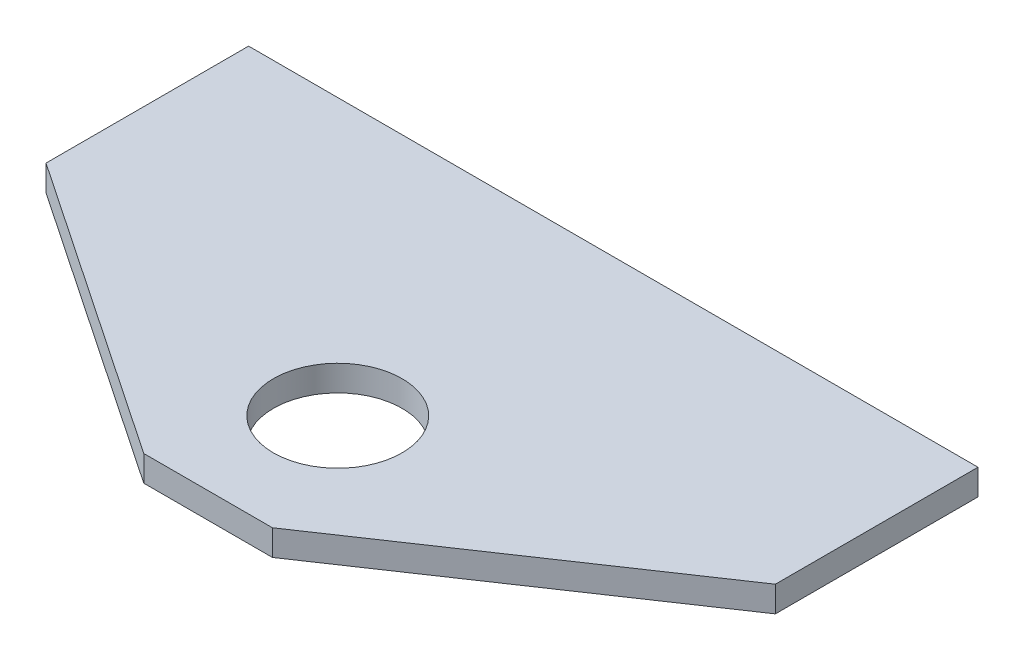
ISO-10303-21;
HEADER;
FILE_DESCRIPTION(('STEP AP214'),'2;1');
FILE_NAME('part.step','',(''),(''),'','','');
FILE_SCHEMA(('AUTOMOTIVE_DESIGN { 1 0 10303 214 1 1 1 1 }'));
ENDSEC;
DATA;
#1=APPLICATION_CONTEXT('core data for automotive mechanical design processes');
#2=APPLICATION_PROTOCOL_DEFINITION('international standard','automotive_design',2000,#1);
#3=PRODUCT_CONTEXT('',#1,'mechanical');
#4=PRODUCT('Part','Part','',(#3));
#5=PRODUCT_RELATED_PRODUCT_CATEGORY('part','',(#4));
#6=PRODUCT_DEFINITION_FORMATION('','',#4);
#7=PRODUCT_DEFINITION_CONTEXT('part definition',#1,'design');
#8=PRODUCT_DEFINITION('design','',#6,#7);
#9=PRODUCT_DEFINITION_SHAPE('','',#8);
#10=(LENGTH_UNIT() NAMED_UNIT(*) SI_UNIT(.MILLI.,.METRE.));
#11=(NAMED_UNIT(*) PLANE_ANGLE_UNIT() SI_UNIT($,.RADIAN.));
#12=(NAMED_UNIT(*) SI_UNIT($,.STERADIAN.) SOLID_ANGLE_UNIT());
#13=UNCERTAINTY_MEASURE_WITH_UNIT(LENGTH_MEASURE(1.E-05),#10,'distance_accuracy_value','');
#14=(GEOMETRIC_REPRESENTATION_CONTEXT(3) GLOBAL_UNCERTAINTY_ASSIGNED_CONTEXT((#13)) GLOBAL_UNIT_ASSIGNED_CONTEXT((#10,
#11,#12)) REPRESENTATION_CONTEXT('',''));
#15=CARTESIAN_POINT('',(0.,0.,0.));
#16=DIRECTION('',(0.,0.,1.));
#17=DIRECTION('',(1.,0.,0.));
#18=AXIS2_PLACEMENT_3D('',#15,#16,#17);
#19=CARTESIAN_POINT('',(-12.8310619194018,1.5875,19.0220492955131));
#20=DIRECTION('',(0.559208709129452,0.,-0.829026911284412));
#21=DIRECTION('',(-0.829026911284412,0.,-0.559208709129452));
#22=AXIS2_PLACEMENT_3D('',#19,#20,#21);
#23=PLANE('',#22);
#24=DIRECTION('',(0.829026911284412,0.,0.559208709129452));
#25=VECTOR('',#24,1.);
#26=CARTESIAN_POINT('',(-12.8310619194018,0.,19.0220492955131));
#27=LINE('',#26,#25);
#28=CARTESIAN_POINT('',(-22.5,0.,12.5));
#29=VERTEX_POINT('',#28);
#30=CARTESIAN_POINT('',(-3.96875,0.,25.));
#31=VERTEX_POINT('',#30);
#32=EDGE_CURVE('E123',#29,#31,#27,.T.);
#33=ORIENTED_EDGE('',*,*,#32,.T.);
#34=DIRECTION('',(0.,-1.,0.));
#35=VECTOR('',#34,1.);
#36=CARTESIAN_POINT('',(-3.96875,1.5875,25.));
#37=LINE('',#36,#35);
#38=CARTESIAN_POINT('',(-3.96875,1.5875,25.));
#39=VERTEX_POINT('',#38);
#40=EDGE_CURVE('E11',#39,#31,#37,.T.);
#41=ORIENTED_EDGE('',*,*,#40,.F.);
#42=DIRECTION('',(0.829026911284412,0.,0.559208709129452));
#43=VECTOR('',#42,1.);
#44=CARTESIAN_POINT('',(-12.8310619194018,1.5875,19.0220492955131));
#45=LINE('',#44,#43);
#46=CARTESIAN_POINT('',(-22.5,1.5875,12.5));
#47=VERTEX_POINT('',#46);
#48=EDGE_CURVE('E149',#47,#39,#45,.T.);
#49=ORIENTED_EDGE('',*,*,#48,.F.);
#50=DIRECTION('',(0.,-1.,0.));
#51=VECTOR('',#50,1.);
#52=CARTESIAN_POINT('',(-22.5,1.5875,12.5));
#53=LINE('',#52,#51);
#54=EDGE_CURVE('E116',#47,#29,#53,.T.);
#55=ORIENTED_EDGE('',*,*,#54,.T.);
#56=EDGE_LOOP('',(#33,#41,#49,#55));
#57=FACE_BOUND('',#56,.T.);
#58=ADVANCED_FACE('F37',(#57),#23,.F.);
#59=CARTESIAN_POINT('',(0.,1.5875,25.));
#60=DIRECTION('',(0.,0.,-1.));
#61=DIRECTION('',(-1.,0.,0.));
#62=AXIS2_PLACEMENT_3D('',#59,#60,#61);
#63=PLANE('',#62);
#64=DIRECTION('',(1.,0.,0.));
#65=VECTOR('',#64,1.);
#66=CARTESIAN_POINT('',(0.,0.,25.));
#67=LINE('',#66,#65);
#68=CARTESIAN_POINT('',(3.96875,0.,25.));
#69=VERTEX_POINT('',#68);
#70=EDGE_CURVE('E126',#31,#69,#67,.T.);
#71=ORIENTED_EDGE('',*,*,#70,.T.);
#72=DIRECTION('',(0.,-1.,0.));
#73=VECTOR('',#72,1.);
#74=CARTESIAN_POINT('',(3.96875,1.5875,25.));
#75=LINE('',#74,#73);
#76=CARTESIAN_POINT('',(3.96875,1.5875,25.));
#77=VERTEX_POINT('',#76);
#78=EDGE_CURVE('E46',#77,#69,#75,.T.);
#79=ORIENTED_EDGE('',*,*,#78,.F.);
#80=DIRECTION('',(1.,0.,0.));
#81=VECTOR('',#80,1.);
#82=CARTESIAN_POINT('',(0.,1.5875,25.));
#83=LINE('',#82,#81);
#84=EDGE_CURVE('E87',#39,#77,#83,.T.);
#85=ORIENTED_EDGE('',*,*,#84,.F.);
#86=ORIENTED_EDGE('',*,*,#40,.T.);
#87=EDGE_LOOP('',(#71,#79,#85,#86));
#88=FACE_BOUND('',#87,.T.);
#89=ADVANCED_FACE('F142',(#88),#63,.F.);
#90=CARTESIAN_POINT('',(12.8310619194018,1.5875,19.0220492955131));
#91=DIRECTION('',(0.559208709129452,0.,0.829026911284412));
#92=DIRECTION('',(0.829026911284412,0.,-0.559208709129452));
#93=AXIS2_PLACEMENT_3D('',#90,#91,#92);
#94=PLANE('',#93);
#95=DIRECTION('',(-0.829026911284412,0.,0.559208709129452));
#96=VECTOR('',#95,1.);
#97=CARTESIAN_POINT('',(12.8310619194018,0.,19.0220492955131));
#98=LINE('',#97,#96);
#99=CARTESIAN_POINT('',(22.5,0.,12.5));
#100=VERTEX_POINT('',#99);
#101=EDGE_CURVE('E129',#100,#69,#98,.T.);
#102=ORIENTED_EDGE('',*,*,#101,.F.);
#103=DIRECTION('',(0.,-1.,0.));
#104=VECTOR('',#103,1.);
#105=CARTESIAN_POINT('',(22.5,1.5875,12.5));
#106=LINE('',#105,#104);
#107=CARTESIAN_POINT('',(22.5,1.5875,12.5));
#108=VERTEX_POINT('',#107);
#109=EDGE_CURVE('E106',#108,#100,#106,.T.);
#110=ORIENTED_EDGE('',*,*,#109,.F.);
#111=DIRECTION('',(-0.829026911284412,0.,0.559208709129452));
#112=VECTOR('',#111,1.);
#113=CARTESIAN_POINT('',(12.8310619194018,1.5875,19.0220492955131));
#114=LINE('',#113,#112);
#115=EDGE_CURVE('E112',#108,#77,#114,.T.);
#116=ORIENTED_EDGE('',*,*,#115,.T.);
#117=ORIENTED_EDGE('',*,*,#78,.T.);
#118=EDGE_LOOP('',(#102,#110,#116,#117));
#119=FACE_BOUND('',#118,.T.);
#120=ADVANCED_FACE('F141',(#119),#94,.T.);
#121=CARTESIAN_POINT('',(22.5,1.5875,0.));
#122=DIRECTION('',(1.,0.,0.));
#123=DIRECTION('',(0.,0.,-1.));
#124=AXIS2_PLACEMENT_3D('',#121,#122,#123);
#125=PLANE('',#124);
#126=DIRECTION('',(0.,0.,1.));
#127=VECTOR('',#126,1.);
#128=CARTESIAN_POINT('',(22.5,0.,0.));
#129=LINE('',#128,#127);
#130=CARTESIAN_POINT('',(22.5,0.,0.));
#131=VERTEX_POINT('',#130);
#132=EDGE_CURVE('E101',#131,#100,#129,.T.);
#133=ORIENTED_EDGE('',*,*,#132,.F.);
#134=DIRECTION('',(0.,-1.,0.));
#135=VECTOR('',#134,1.);
#136=CARTESIAN_POINT('',(22.5,1.5875,0.));
#137=LINE('',#136,#135);
#138=CARTESIAN_POINT('',(22.5,1.5875,0.));
#139=VERTEX_POINT('',#138);
#140=EDGE_CURVE('E96',#139,#131,#137,.T.);
#141=ORIENTED_EDGE('',*,*,#140,.F.);
#142=DIRECTION('',(0.,0.,1.));
#143=VECTOR('',#142,1.);
#144=CARTESIAN_POINT('',(22.5,1.5875,0.));
#145=LINE('',#144,#143);
#146=EDGE_CURVE('E99',#139,#108,#145,.T.);
#147=ORIENTED_EDGE('',*,*,#146,.T.);
#148=ORIENTED_EDGE('',*,*,#109,.T.);
#149=EDGE_LOOP('',(#133,#141,#147,#148));
#150=FACE_BOUND('',#149,.T.);
#151=ADVANCED_FACE('F98',(#150),#125,.T.);
#152=CARTESIAN_POINT('',(0.,1.5875,0.));
#153=DIRECTION('',(0.,0.,-1.));
#154=DIRECTION('',(-1.,0.,0.));
#155=AXIS2_PLACEMENT_3D('',#152,#153,#154);
#156=PLANE('',#155);
#157=DIRECTION('',(1.,0.,0.));
#158=VECTOR('',#157,1.);
#159=CARTESIAN_POINT('',(0.,0.,0.));
#160=LINE('',#159,#158);
#161=CARTESIAN_POINT('',(-22.5,0.,0.));
#162=VERTEX_POINT('',#161);
#163=EDGE_CURVE('E133',#162,#131,#160,.T.);
#164=ORIENTED_EDGE('',*,*,#163,.F.);
#165=DIRECTION('',(0.,-1.,0.));
#166=VECTOR('',#165,1.);
#167=CARTESIAN_POINT('',(-22.5,1.5875,0.));
#168=LINE('',#167,#166);
#169=CARTESIAN_POINT('',(-22.5,1.5875,0.));
#170=VERTEX_POINT('',#169);
#171=EDGE_CURVE('E76',#170,#162,#168,.T.);
#172=ORIENTED_EDGE('',*,*,#171,.F.);
#173=DIRECTION('',(1.,0.,0.));
#174=VECTOR('',#173,1.);
#175=CARTESIAN_POINT('',(0.,1.5875,0.));
#176=LINE('',#175,#174);
#177=EDGE_CURVE('E110',#170,#139,#176,.T.);
#178=ORIENTED_EDGE('',*,*,#177,.T.);
#179=ORIENTED_EDGE('',*,*,#140,.T.);
#180=EDGE_LOOP('',(#164,#172,#178,#179));
#181=FACE_BOUND('',#180,.T.);
#182=ADVANCED_FACE('F114',(#181),#156,.T.);
#183=CARTESIAN_POINT('',(0.,1.5875,17.));
#184=DIRECTION('',(0.,-1.,0.));
#185=DIRECTION('',(0.,0.,-1.));
#186=AXIS2_PLACEMENT_3D('',#183,#184,#185);
#187=CYLINDRICAL_SURFACE('',#186,3.96875);
#188=CARTESIAN_POINT('',(0.,1.5875,17.));
#189=DIRECTION('',(0.,1.,0.));
#190=DIRECTION('',(0.,0.,1.));
#191=AXIS2_PLACEMENT_3D('',#188,#189,#190);
#192=CIRCLE('',#191,3.96875);
#193=CARTESIAN_POINT('',(0.,1.5875,20.96875));
#194=VERTEX_POINT('',#193);
#195=EDGE_CURVE('E136',#194,#194,#192,.T.);
#196=ORIENTED_EDGE('',*,*,#195,.T.);
#197=EDGE_LOOP('',(#196));
#198=FACE_BOUND('',#197,.T.);
#199=CARTESIAN_POINT('',(0.,0.,17.));
#200=DIRECTION('',(0.,1.,0.));
#201=DIRECTION('',(0.,0.,1.));
#202=AXIS2_PLACEMENT_3D('',#199,#200,#201);
#203=CIRCLE('',#202,3.96875);
#204=CARTESIAN_POINT('',(0.,0.,20.96875));
#205=VERTEX_POINT('',#204);
#206=EDGE_CURVE('E120',#205,#205,#203,.T.);
#207=ORIENTED_EDGE('',*,*,#206,.F.);
#208=EDGE_LOOP('',(#207));
#209=FACE_BOUND('',#208,.T.);
#210=ADVANCED_FACE('F39',(#198,#209),#187,.F.);
#211=CARTESIAN_POINT('',(-22.5,1.5875,0.));
#212=DIRECTION('',(1.,0.,0.));
#213=DIRECTION('',(0.,0.,-1.));
#214=AXIS2_PLACEMENT_3D('',#211,#212,#213);
#215=PLANE('',#214);
#216=DIRECTION('',(0.,0.,1.));
#217=VECTOR('',#216,1.);
#218=CARTESIAN_POINT('',(-22.5,0.,0.));
#219=LINE('',#218,#217);
#220=EDGE_CURVE('E79',#162,#29,#219,.T.);
#221=ORIENTED_EDGE('',*,*,#220,.T.);
#222=ORIENTED_EDGE('',*,*,#54,.F.);
#223=DIRECTION('',(0.,0.,1.));
#224=VECTOR('',#223,1.);
#225=CARTESIAN_POINT('',(-22.5,1.5875,0.));
#226=LINE('',#225,#224);
#227=EDGE_CURVE('E54',#170,#47,#226,.T.);
#228=ORIENTED_EDGE('',*,*,#227,.F.);
#229=ORIENTED_EDGE('',*,*,#171,.T.);
#230=EDGE_LOOP('',(#221,#222,#228,#229));
#231=FACE_BOUND('',#230,.T.);
#232=ADVANCED_FACE('F150',(#231),#215,.F.);
#233=CARTESIAN_POINT('',(0.,1.5875,0.));
#234=DIRECTION('',(0.,1.,0.));
#235=DIRECTION('',(0.,0.,1.));
#236=AXIS2_PLACEMENT_3D('',#233,#234,#235);
#237=PLANE('',#236);
#238=ORIENTED_EDGE('',*,*,#195,.F.);
#239=EDGE_LOOP('',(#238));
#240=FACE_BOUND('',#239,.T.);
#241=ORIENTED_EDGE('',*,*,#48,.T.);
#242=ORIENTED_EDGE('',*,*,#84,.T.);
#243=ORIENTED_EDGE('',*,*,#115,.F.);
#244=ORIENTED_EDGE('',*,*,#146,.F.);
#245=ORIENTED_EDGE('',*,*,#177,.F.);
#246=ORIENTED_EDGE('',*,*,#227,.T.);
#247=EDGE_LOOP('',(#241,#242,#243,#244,#245,#246));
#248=FACE_BOUND('',#247,.T.);
#249=ADVANCED_FACE('F109',(#240,#248),#237,.T.);
#250=CARTESIAN_POINT('',(0.,0.,0.));
#251=DIRECTION('',(0.,1.,0.));
#252=DIRECTION('',(0.,0.,1.));
#253=AXIS2_PLACEMENT_3D('',#250,#251,#252);
#254=PLANE('',#253);
#255=ORIENTED_EDGE('',*,*,#206,.T.);
#256=EDGE_LOOP('',(#255));
#257=FACE_BOUND('',#256,.T.);
#258=ORIENTED_EDGE('',*,*,#32,.F.);
#259=ORIENTED_EDGE('',*,*,#220,.F.);
#260=ORIENTED_EDGE('',*,*,#163,.T.);
#261=ORIENTED_EDGE('',*,*,#132,.T.);
#262=ORIENTED_EDGE('',*,*,#101,.T.);
#263=ORIENTED_EDGE('',*,*,#70,.F.);
#264=EDGE_LOOP('',(#258,#259,#260,#261,#262,#263));
#265=FACE_BOUND('',#264,.T.);
#266=ADVANCED_FACE('F146',(#257,#265),#254,.F.);
#267=CLOSED_SHELL('',(#58,#89,#120,#151,#182,#210,#232,#249,#266));
#268=MANIFOLD_SOLID_BREP('B2',#267);
#269=ADVANCED_BREP_SHAPE_REPRESENTATION('',(#18,#268),#14);
#270=SHAPE_DEFINITION_REPRESENTATION(#9,#269);
ENDSEC;
END-ISO-10303-21;
